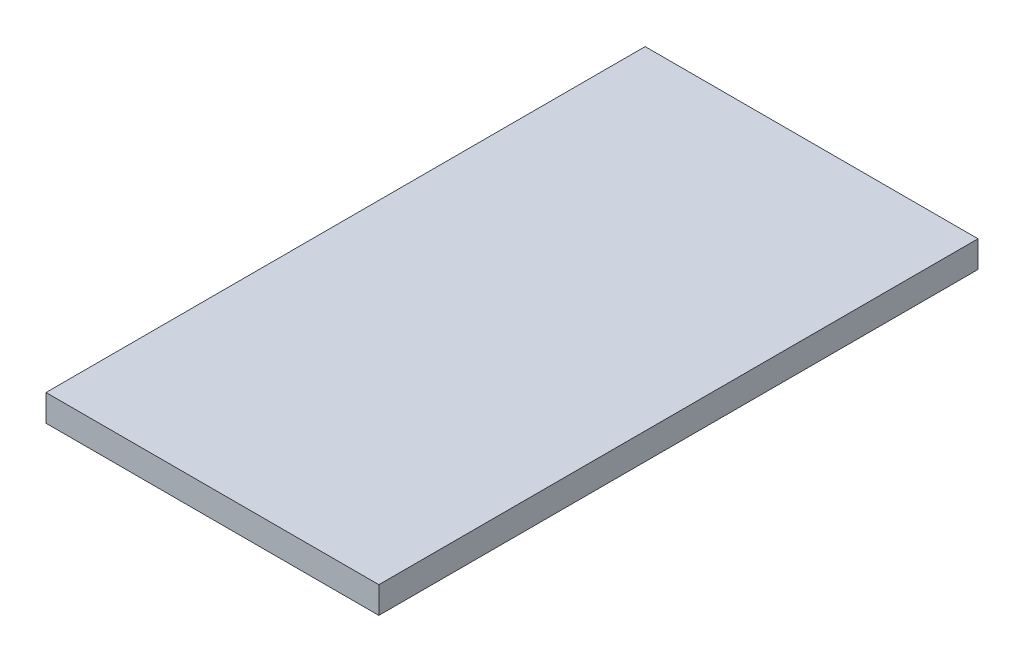
ISO-10303-21;
HEADER;
FILE_DESCRIPTION(('STEP AP214'),'2;1');
FILE_NAME('part.step','',(''),(''),'','','');
FILE_SCHEMA(('AUTOMOTIVE_DESIGN { 1 0 10303 214 1 1 1 1 }'));
ENDSEC;
DATA;
#1=APPLICATION_CONTEXT('core data for automotive mechanical design processes');
#2=APPLICATION_PROTOCOL_DEFINITION('international standard','automotive_design',2000,#1);
#3=PRODUCT_CONTEXT('',#1,'mechanical');
#4=PRODUCT('Part','Part','',(#3));
#5=PRODUCT_RELATED_PRODUCT_CATEGORY('part','',(#4));
#6=PRODUCT_DEFINITION_FORMATION('','',#4);
#7=PRODUCT_DEFINITION_CONTEXT('part definition',#1,'design');
#8=PRODUCT_DEFINITION('design','',#6,#7);
#9=PRODUCT_DEFINITION_SHAPE('','',#8);
#10=(LENGTH_UNIT() NAMED_UNIT(*) SI_UNIT(.MILLI.,.METRE.));
#11=(NAMED_UNIT(*) PLANE_ANGLE_UNIT() SI_UNIT($,.RADIAN.));
#12=(NAMED_UNIT(*) SI_UNIT($,.STERADIAN.) SOLID_ANGLE_UNIT());
#13=UNCERTAINTY_MEASURE_WITH_UNIT(LENGTH_MEASURE(1.E-05),#10,'distance_accuracy_value','');
#14=(GEOMETRIC_REPRESENTATION_CONTEXT(3) GLOBAL_UNCERTAINTY_ASSIGNED_CONTEXT((#13)) GLOBAL_UNIT_ASSIGNED_CONTEXT((#10,
#11,#12)) REPRESENTATION_CONTEXT('',''));
#15=CARTESIAN_POINT('',(0.,0.,0.));
#16=DIRECTION('',(0.,0.,1.));
#17=DIRECTION('',(1.,0.,0.));
#18=AXIS2_PLACEMENT_3D('',#15,#16,#17);
#19=CARTESIAN_POINT('',(12.5,2.,-22.5));
#20=DIRECTION('',(-1.,0.,0.));
#21=DIRECTION('',(0.,0.,1.));
#22=AXIS2_PLACEMENT_3D('',#19,#20,#21);
#23=PLANE('',#22);
#24=DIRECTION('',(0.,0.,-1.));
#25=VECTOR('',#24,1.);
#26=CARTESIAN_POINT('',(12.5,0.,-22.5));
#27=LINE('',#26,#25);
#28=CARTESIAN_POINT('',(12.5,0.,22.5));
#29=VERTEX_POINT('',#28);
#30=CARTESIAN_POINT('',(12.5,0.,-22.5));
#31=VERTEX_POINT('',#30);
#32=EDGE_CURVE('E96',#29,#31,#27,.T.);
#33=ORIENTED_EDGE('',*,*,#32,.T.);
#34=DIRECTION('',(0.,-1.,0.));
#35=VECTOR('',#34,1.);
#36=CARTESIAN_POINT('',(12.5,2.,-22.5));
#37=LINE('',#36,#35);
#38=CARTESIAN_POINT('',(12.5,2.,-22.5));
#39=VERTEX_POINT('',#38);
#40=EDGE_CURVE('E11',#39,#31,#37,.T.);
#41=ORIENTED_EDGE('',*,*,#40,.F.);
#42=DIRECTION('',(0.,0.,-1.));
#43=VECTOR('',#42,1.);
#44=CARTESIAN_POINT('',(12.5,2.,-22.5));
#45=LINE('',#44,#43);
#46=CARTESIAN_POINT('',(12.5,2.,22.5));
#47=VERTEX_POINT('',#46);
#48=EDGE_CURVE('E84',#47,#39,#45,.T.);
#49=ORIENTED_EDGE('',*,*,#48,.F.);
#50=DIRECTION('',(0.,-1.,0.));
#51=VECTOR('',#50,1.);
#52=CARTESIAN_POINT('',(12.5,2.,22.5));
#53=LINE('',#52,#51);
#54=EDGE_CURVE('E92',#47,#29,#53,.T.);
#55=ORIENTED_EDGE('',*,*,#54,.T.);
#56=EDGE_LOOP('',(#33,#41,#49,#55));
#57=FACE_BOUND('',#56,.T.);
#58=ADVANCED_FACE('F33',(#57),#23,.F.);
#59=CARTESIAN_POINT('',(-12.5,2.,-22.5));
#60=DIRECTION('',(0.,0.,1.));
#61=DIRECTION('',(1.,0.,0.));
#62=AXIS2_PLACEMENT_3D('',#59,#60,#61);
#63=PLANE('',#62);
#64=DIRECTION('',(-1.,0.,0.));
#65=VECTOR('',#64,1.);
#66=CARTESIAN_POINT('',(-12.5,0.,-22.5));
#67=LINE('',#66,#65);
#68=CARTESIAN_POINT('',(-12.5,0.,-22.5));
#69=VERTEX_POINT('',#68);
#70=EDGE_CURVE('E88',#31,#69,#67,.T.);
#71=ORIENTED_EDGE('',*,*,#70,.T.);
#72=DIRECTION('',(0.,-1.,0.));
#73=VECTOR('',#72,1.);
#74=CARTESIAN_POINT('',(-12.5,2.,-22.5));
#75=LINE('',#74,#73);
#76=CARTESIAN_POINT('',(-12.5,2.,-22.5));
#77=VERTEX_POINT('',#76);
#78=EDGE_CURVE('E41',#77,#69,#75,.T.);
#79=ORIENTED_EDGE('',*,*,#78,.F.);
#80=DIRECTION('',(-1.,0.,0.));
#81=VECTOR('',#80,1.);
#82=CARTESIAN_POINT('',(-12.5,2.,-22.5));
#83=LINE('',#82,#81);
#84=EDGE_CURVE('E79',#39,#77,#83,.T.);
#85=ORIENTED_EDGE('',*,*,#84,.F.);
#86=ORIENTED_EDGE('',*,*,#40,.T.);
#87=EDGE_LOOP('',(#71,#79,#85,#86));
#88=FACE_BOUND('',#87,.T.);
#89=ADVANCED_FACE('F87',(#88),#63,.F.);
#90=CARTESIAN_POINT('',(-12.5,2.,-22.5));
#91=DIRECTION('',(1.,0.,0.));
#92=DIRECTION('',(0.,0.,-1.));
#93=AXIS2_PLACEMENT_3D('',#90,#91,#92);
#94=PLANE('',#93);
#95=DIRECTION('',(0.,0.,1.));
#96=VECTOR('',#95,1.);
#97=CARTESIAN_POINT('',(-12.5,0.,-22.5));
#98=LINE('',#97,#96);
#99=CARTESIAN_POINT('',(-12.5,0.,22.5));
#100=VERTEX_POINT('',#99);
#101=EDGE_CURVE('E66',#69,#100,#98,.T.);
#102=ORIENTED_EDGE('',*,*,#101,.T.);
#103=DIRECTION('',(0.,-1.,0.));
#104=VECTOR('',#103,1.);
#105=CARTESIAN_POINT('',(-12.5,2.,22.5));
#106=LINE('',#105,#104);
#107=CARTESIAN_POINT('',(-12.5,2.,22.5));
#108=VERTEX_POINT('',#107);
#109=EDGE_CURVE('E89',#108,#100,#106,.T.);
#110=ORIENTED_EDGE('',*,*,#109,.F.);
#111=DIRECTION('',(0.,0.,1.));
#112=VECTOR('',#111,1.);
#113=CARTESIAN_POINT('',(-12.5,2.,-22.5));
#114=LINE('',#113,#112);
#115=EDGE_CURVE('E82',#77,#108,#114,.T.);
#116=ORIENTED_EDGE('',*,*,#115,.F.);
#117=ORIENTED_EDGE('',*,*,#78,.T.);
#118=EDGE_LOOP('',(#102,#110,#116,#117));
#119=FACE_BOUND('',#118,.T.);
#120=ADVANCED_FACE('F90',(#119),#94,.F.);
#121=CARTESIAN_POINT('',(-12.5,2.,22.5));
#122=DIRECTION('',(0.,0.,-1.));
#123=DIRECTION('',(-1.,0.,0.));
#124=AXIS2_PLACEMENT_3D('',#121,#122,#123);
#125=PLANE('',#124);
#126=DIRECTION('',(1.,0.,0.));
#127=VECTOR('',#126,1.);
#128=CARTESIAN_POINT('',(-12.5,0.,22.5));
#129=LINE('',#128,#127);
#130=EDGE_CURVE('E72',#100,#29,#129,.T.);
#131=ORIENTED_EDGE('',*,*,#130,.T.);
#132=ORIENTED_EDGE('',*,*,#54,.F.);
#133=DIRECTION('',(1.,0.,0.));
#134=VECTOR('',#133,1.);
#135=CARTESIAN_POINT('',(-12.5,2.,22.5));
#136=LINE('',#135,#134);
#137=EDGE_CURVE('E49',#108,#47,#136,.T.);
#138=ORIENTED_EDGE('',*,*,#137,.F.);
#139=ORIENTED_EDGE('',*,*,#109,.T.);
#140=EDGE_LOOP('',(#131,#132,#138,#139));
#141=FACE_BOUND('',#140,.T.);
#142=ADVANCED_FACE('F103',(#141),#125,.F.);
#143=CARTESIAN_POINT('',(0.,2.,0.));
#144=DIRECTION('',(0.,1.,0.));
#145=DIRECTION('',(0.,0.,1.));
#146=AXIS2_PLACEMENT_3D('',#143,#144,#145);
#147=PLANE('',#146);
#148=ORIENTED_EDGE('',*,*,#48,.T.);
#149=ORIENTED_EDGE('',*,*,#84,.T.);
#150=ORIENTED_EDGE('',*,*,#115,.T.);
#151=ORIENTED_EDGE('',*,*,#137,.T.);
#152=EDGE_LOOP('',(#148,#149,#150,#151));
#153=FACE_BOUND('',#152,.T.);
#154=ADVANCED_FACE('F80',(#153),#147,.T.);
#155=CARTESIAN_POINT('',(0.,0.,0.));
#156=DIRECTION('',(0.,1.,0.));
#157=DIRECTION('',(0.,0.,1.));
#158=AXIS2_PLACEMENT_3D('',#155,#156,#157);
#159=PLANE('',#158);
#160=ORIENTED_EDGE('',*,*,#32,.F.);
#161=ORIENTED_EDGE('',*,*,#130,.F.);
#162=ORIENTED_EDGE('',*,*,#101,.F.);
#163=ORIENTED_EDGE('',*,*,#70,.F.);
#164=EDGE_LOOP('',(#160,#161,#162,#163));
#165=FACE_BOUND('',#164,.T.);
#166=ADVANCED_FACE('F106',(#165),#159,.F.);
#167=CLOSED_SHELL('',(#58,#89,#120,#142,#154,#166));
#168=MANIFOLD_SOLID_BREP('B2',#167);
#169=ADVANCED_BREP_SHAPE_REPRESENTATION('',(#18,#168),#14);
#170=SHAPE_DEFINITION_REPRESENTATION(#9,#169);
ENDSEC;
END-ISO-10303-21;
